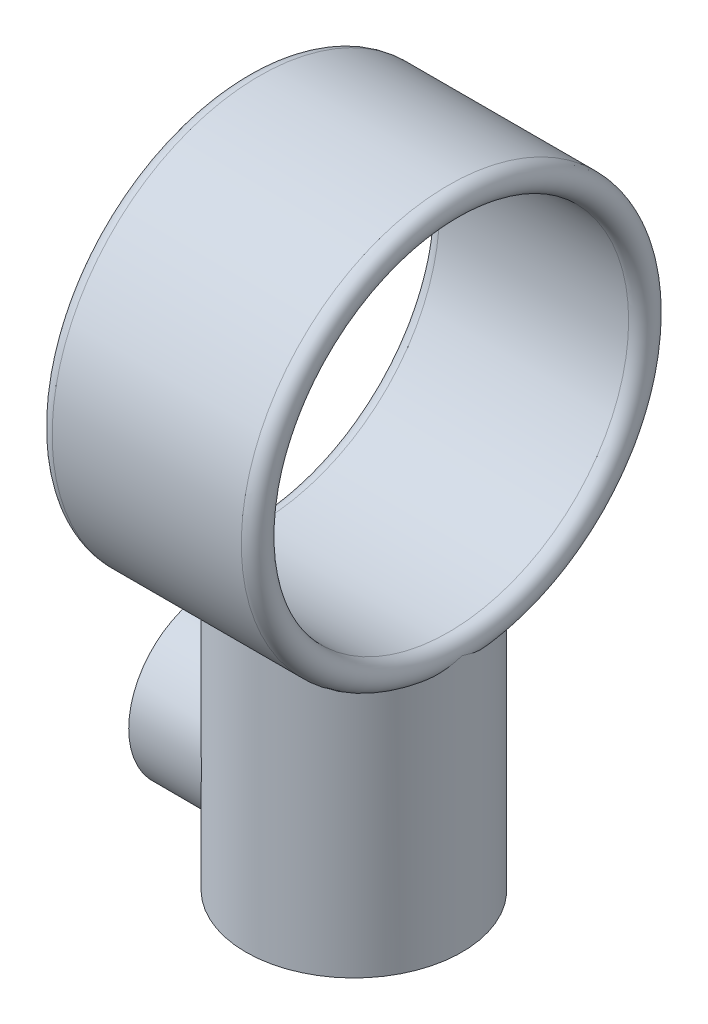
ISO-10303-21;
HEADER;
FILE_DESCRIPTION(('STEP AP214'),'2;1');
FILE_NAME('part.step','',(''),(''),'','','');
FILE_SCHEMA(('AUTOMOTIVE_DESIGN { 1 0 10303 214 1 1 1 1 }'));
ENDSEC;
DATA;
#1=APPLICATION_CONTEXT('core data for automotive mechanical design processes');
#2=APPLICATION_PROTOCOL_DEFINITION('international standard','automotive_design',2000,#1);
#3=PRODUCT_CONTEXT('',#1,'mechanical');
#4=PRODUCT('Part','Part','',(#3));
#5=PRODUCT_RELATED_PRODUCT_CATEGORY('part','',(#4));
#6=PRODUCT_DEFINITION_FORMATION('','',#4);
#7=PRODUCT_DEFINITION_CONTEXT('part definition',#1,'design');
#8=PRODUCT_DEFINITION('design','',#6,#7);
#9=PRODUCT_DEFINITION_SHAPE('','',#8);
#10=(LENGTH_UNIT() NAMED_UNIT(*) SI_UNIT(.MILLI.,.METRE.));
#11=(NAMED_UNIT(*) PLANE_ANGLE_UNIT() SI_UNIT($,.RADIAN.));
#12=(NAMED_UNIT(*) SI_UNIT($,.STERADIAN.) SOLID_ANGLE_UNIT());
#13=UNCERTAINTY_MEASURE_WITH_UNIT(LENGTH_MEASURE(1.E-05),#10,'distance_accuracy_value','');
#14=(GEOMETRIC_REPRESENTATION_CONTEXT(3) GLOBAL_UNCERTAINTY_ASSIGNED_CONTEXT((#13)) GLOBAL_UNIT_ASSIGNED_CONTEXT((#10,
#11,#12)) REPRESENTATION_CONTEXT('',''));
#15=CARTESIAN_POINT('',(0.,0.,0.));
#16=DIRECTION('',(0.,0.,1.));
#17=DIRECTION('',(1.,0.,0.));
#18=AXIS2_PLACEMENT_3D('',#15,#16,#17);
#19=CARTESIAN_POINT('',(-3.70809924354783,10.,0.));
#20=DIRECTION('',(1.,0.,0.));
#21=DIRECTION('',(0.,0.,-1.));
#22=AXIS2_PLACEMENT_3D('',#19,#20,#21);
#23=PLANE('',#22);
#24=CARTESIAN_POINT('',(-3.70809924354783,6.,0.));
#25=DIRECTION('',(1.,0.,0.));
#26=DIRECTION('',(0.,0.,-1.));
#27=AXIS2_PLACEMENT_3D('',#24,#25,#26);
#28=CIRCLE('',#27,1.5);
#29=CARTESIAN_POINT('',(-3.70809924354783,6.,1.5));
#30=VERTEX_POINT('',#29);
#31=CARTESIAN_POINT('',(-3.70809924354783,6.,-1.5));
#32=VERTEX_POINT('',#31);
#33=EDGE_CURVE('E66',#30,#32,#28,.F.);
#34=ORIENTED_EDGE('',*,*,#33,.T.);
#35=DIRECTION('',(0.,-1.,0.));
#36=VECTOR('',#35,1.);
#37=CARTESIAN_POINT('',(-3.70809924354783,10.,-1.5));
#38=LINE('',#37,#36);
#39=CARTESIAN_POINT('',(-3.70809924354783,10.,-1.5));
#40=VERTEX_POINT('',#39);
#41=EDGE_CURVE('E115',#40,#32,#38,.T.);
#42=ORIENTED_EDGE('',*,*,#41,.F.);
#43=DIRECTION('',(0.,0.,1.));
#44=VECTOR('',#43,1.);
#45=CARTESIAN_POINT('',(-3.70809924354783,10.,0.));
#46=LINE('',#45,#44);
#47=CARTESIAN_POINT('',(-3.70809924354783,10.,1.5));
#48=VERTEX_POINT('',#47);
#49=EDGE_CURVE('E361',#40,#48,#46,.T.);
#50=ORIENTED_EDGE('',*,*,#49,.T.);
#51=DIRECTION('',(0.,-1.,0.));
#52=VECTOR('',#51,1.);
#53=CARTESIAN_POINT('',(-3.70809924354783,10.,1.5));
#54=LINE('',#53,#52);
#55=EDGE_CURVE('E118',#48,#30,#54,.T.);
#56=ORIENTED_EDGE('',*,*,#55,.T.);
#57=EDGE_LOOP('',(#34,#42,#50,#56));
#58=FACE_BOUND('',#57,.T.);
#59=ADVANCED_FACE('F45',(#58),#23,.T.);
#60=CARTESIAN_POINT('',(0.,38.001,0.));
#61=DIRECTION('',(0.,-1.,0.));
#62=DIRECTION('',(0.,0.,-1.));
#63=AXIS2_PLACEMENT_3D('',#60,#61,#62);
#64=CYLINDRICAL_SURFACE('',#63,6.);
#65=CARTESIAN_POINT('',(-5.25,13.8728934578661,2.90473750965556));
#66=CARTESIAN_POINT('',(-5.16545083744711,13.9127705274958,3.05755950121399));
#67=CARTESIAN_POINT('',(-5.07449851944559,13.9549493380977,3.20618748854696));
#68=CARTESIAN_POINT('',(-4.88059842888493,14.0426881679961,3.49426359831979));
#69=CARTESIAN_POINT('',(-4.77765518090891,14.0882469095894,3.63371515245411));
#70=CARTESIAN_POINT('',(-4.56036266579937,14.1816224568367,3.90295671131616));
#71=CARTESIAN_POINT('',(-4.44599715516383,14.2294424258153,4.03273248498849));
#72=CARTESIAN_POINT('',(-4.20668306419332,14.326004070393,4.28178043051138));
#73=CARTESIAN_POINT('',(-4.08173338874433,14.374745840962,4.40105151286026));
#74=CARTESIAN_POINT('',(-3.82202654993289,14.4717811308047,4.6283769765949));
#75=CARTESIAN_POINT('',(-3.68727657717876,14.5200749499888,4.7364394434313));
#76=CARTESIAN_POINT('',(-3.40855123542649,14.6148640065689,4.94081366135508));
#77=CARTESIAN_POINT('',(-3.26457635770231,14.6613593395326,5.03712603740368));
#78=CARTESIAN_POINT('',(-2.96812957090151,14.7511050336043,5.21730601959085));
#79=CARTESIAN_POINT('',(-2.8156602232121,14.7943563637643,5.30117734951102));
#80=CARTESIAN_POINT('',(-2.50297273239522,14.876161190341,5.4557805607689));
#81=CARTESIAN_POINT('',(-2.34275458297037,14.9147146829396,5.52651243142803));
#82=CARTESIAN_POINT('',(-2.01838468028311,14.9850483133558,5.65295418327766));
#83=CARTESIAN_POINT('',(-1.8543497737595,15.0169345747475,5.70890389276414));
#84=CARTESIAN_POINT('',(-1.52096581806244,15.0734507795979,5.80661800910458));
#85=CARTESIAN_POINT('',(-1.351619645987,15.0980845790624,5.84838995583623));
#86=CARTESIAN_POINT('',(-1.00913314120326,15.1389917083967,5.91710392755813));
#87=CARTESIAN_POINT('',(-0.835997149047921,15.1552741293284,5.94406208069449));
#88=CARTESIAN_POINT('',(-0.487427727690023,15.1787284785597,5.98273743133931));
#89=CARTESIAN_POINT('',(-0.311994684367149,15.1859019177248,5.9944571563843));
#90=CARTESIAN_POINT('',(0.014898456154254,15.1904470911778,6.00188922956027));
#91=CARTESIAN_POINT('',(0.166300455664945,15.1890429147838,5.99960057509896));
#92=CARTESIAN_POINT('',(0.468270660017704,15.179281646702,5.98360932456145));
#93=CARTESIAN_POINT('',(0.618838898064245,15.1709248339363,5.96990718636529));
#94=CARTESIAN_POINT('',(0.918024530416322,15.1475622872583,5.9312713603667));
#95=CARTESIAN_POINT('',(1.06664165939207,15.1325556584913,5.90633616094247));
#96=CARTESIAN_POINT('',(1.36083888564339,15.096438757638,5.8455716929049));
#97=CARTESIAN_POINT('',(1.50641888995803,15.0753282990174,5.80974209135476));
#98=CARTESIAN_POINT('',(1.92883597054698,15.0052477261695,5.68889393624443));
#99=CARTESIAN_POINT('',(2.20040553295174,14.9487439552119,5.58929867537032));
#100=CARTESIAN_POINT('',(2.72363828628705,14.8214214644377,5.35390893323802));
#101=CARTESIAN_POINT('',(2.97528804700097,14.7505931993137,5.21809029473828));
#102=CARTESIAN_POINT('',(3.48623784079228,14.5914676938904,4.89378523820748));
#103=CARTESIAN_POINT('',(3.74232631838541,14.502095762168,4.70076153775123));
#104=CARTESIAN_POINT('',(4.22026271887615,14.3223800597999,4.27683145749983));
#105=CARTESIAN_POINT('',(4.44213765172656,14.2320371166239,4.04595526063284));
#106=CARTESIAN_POINT('',(4.75830189696992,14.0967473090789,3.65934294999487));
#107=CARTESIAN_POINT('',(4.86583204867643,14.0492872361129,3.51513265629614));
#108=CARTESIAN_POINT('',(5.06784175314055,13.9580350057277,3.21703823558775));
#109=CARTESIAN_POINT('',(5.16233716991498,13.9142384156674,3.06316620553971));
#110=CARTESIAN_POINT('',(5.25,13.8728934578661,2.90473750965556));
#111=B_SPLINE_CURVE_WITH_KNOTS('',3,(#65,#66,#67,#68,#69,#70,#71,#72,#73,#74,#75,#76,#77,#78,
#79,#80,#81,#82,#83,#84,#85,#86,#87,#88,#89,#90,#91,#92,#93,#94,#95,#96,#97,#98,#99,#100,#101,
#102,#103,#104,#105,#106,#107,#108,#109,#110),.UNSPECIFIED.,.F.,.F.,(4,2,2,2,2,2,2,2,2,2,2,2,2,
2,2,2,2,2,2,2,2,2,4),(0.,0.537198992207626,1.07419593375081,1.61196771208423,2.14979520028817,
2.68723198268515,3.22464016754032,3.76188717251165,4.29913461410687,4.82703991833124,
5.35466403566129,5.88171257157474,6.40867367691955,6.86237029036471,7.31604870352783,
7.76978818598553,8.22354153627678,9.10386976454148,9.9847865549833,10.9795066139687,
11.9734373238748,12.5308951645804,13.0876684455294),.UNSPECIFIED.);
#112=CARTESIAN_POINT('',(-5.25,13.8728934578661,2.90473750965556));
#113=VERTEX_POINT('',#112);
#114=CARTESIAN_POINT('',(5.24999999998495,13.8728934578732,2.90473750968277));
#115=VERTEX_POINT('',#114);
#116=EDGE_CURVE('E60',#113,#115,#111,.T.);
#117=ORIENTED_EDGE('',*,*,#116,.F.);
#118=CARTESIAN_POINT('',(-6.,14.25,0.));
#119=CARTESIAN_POINT('',(-6.00000000150005,14.2482787321846,0.00486850603670994));
#120=CARTESIAN_POINT('',(-5.99999407579352,14.2465603430977,0.00973819779422145));
#121=CARTESIAN_POINT('',(-5.99940107988171,14.1607958041451,0.253254865672289));
#122=CARTESIAN_POINT('',(-5.98457196858083,14.0837357908846,0.494713798348243));
#123=CARTESIAN_POINT('',(-5.92441775295515,13.9512042031537,0.980401033440612));
#124=CARTESIAN_POINT('',(-5.87904343224984,13.8957676978917,1.22463317887321));
#125=CARTESIAN_POINT('',(-5.77226781040316,13.8267679380163,1.64785267390334));
#126=CARTESIAN_POINT('',(-5.71802288428123,13.8060910842963,1.82741438960373));
#127=CARTESIAN_POINT('',(-5.62398391824661,13.792216860086,2.09275079530054));
#128=CARTESIAN_POINT('',(-5.59058908539884,13.7904381959896,2.18039171411812));
#129=CARTESIAN_POINT('',(-5.51977433823358,13.7933541732623,2.35390256474518));
#130=CARTESIAN_POINT('',(-5.48235656141722,13.7980453925231,2.43977340842155));
#131=CARTESIAN_POINT('',(-5.40742240777495,13.8140142601761,2.60133664062631));
#132=CARTESIAN_POINT('',(-5.37022938740991,13.8246488351064,2.67724057666068));
#133=CARTESIAN_POINT('',(-5.293152757581,13.8527779985089,2.82660186282994));
#134=CARTESIAN_POINT('',(-5.2532625595122,13.8702899277422,2.90005251520268));
#135=CARTESIAN_POINT('',(-5.21230000000083,13.8916128402081,2.97185610519611));
#136=B_SPLINE_CURVE_WITH_KNOTS('',3,(#118,#119,#120,#121,#122,#123,#124,#125,#126,#127,#128,
#129,#130,#131,#132,#133,#134,#135),.UNSPECIFIED.,.F.,.F.,(4,2,2,2,2,2,2,2,4),(0.,
0.0154919464335938,0.774512988395745,1.53475994978785,2.09884164947625,2.37998548268988,
2.66098066782649,2.91622180303708,3.17211068582444),.UNSPECIFIED.);
#137=CARTESIAN_POINT('',(-6.00000000000002,14.25,0.));
#138=VERTEX_POINT('',#137);
#139=EDGE_CURVE('E182',#138,#113,#136,.T.);
#140=ORIENTED_EDGE('',*,*,#139,.F.);
#141=CARTESIAN_POINT('',(-5.21230000000083,13.8916128402081,-2.97185610519611));
#142=CARTESIAN_POINT('',(-5.25182109042762,13.8710372587971,-2.90257685264227));
#143=CARTESIAN_POINT('',(-5.2903492931489,13.8540109061448,-2.83175727139901));
#144=CARTESIAN_POINT('',(-5.3649333950461,13.8263925575196,-2.68774914206225));
#145=CARTESIAN_POINT('',(-5.40099330471434,13.815789893052,-2.61456473564402));
#146=CARTESIAN_POINT('',(-5.47003424150393,13.8003478003082,-2.46684847144031));
#147=CARTESIAN_POINT('',(-5.50303593881474,13.7954666104389,-2.39233046004732));
#148=CARTESIAN_POINT('',(-5.5660382288427,13.7907312728859,-2.24184660534412));
#149=CARTESIAN_POINT('',(-5.59603713074492,13.7908799416232,-2.16587997468559));
#150=CARTESIAN_POINT('',(-5.66448428144393,13.796647544105,-1.9816208508093));
#151=CARTESIAN_POINT('',(-5.7013717319264,13.8044783931462,-1.87281176845403));
#152=CARTESIAN_POINT('',(-5.76866472612397,13.8277260724853,-1.65398050024608));
#153=CARTESIAN_POINT('',(-5.79906512416681,13.8431488930727,-1.54395742363985));
#154=CARTESIAN_POINT('',(-5.88059826772668,13.8991641247959,-1.21255594288631));
#155=CARTESIAN_POINT('',(-5.92190036224475,13.9494800901576,-0.990286813456896));
#156=CARTESIAN_POINT('',(-5.96689060925225,14.0429897960054,-0.642372380795412));
#157=CARTESIAN_POINT('',(-5.97910851566229,14.0800632827528,-0.515962025347549));
#158=CARTESIAN_POINT('',(-5.99549567692783,14.1590719416185,-0.264329322031675));
#159=CARTESIAN_POINT('',(-5.99967894596839,14.200998513159,-0.139105285407618));
#160=CARTESIAN_POINT('',(-5.99999407970384,14.2465603158051,-0.0097382553445154));
#161=CARTESIAN_POINT('',(-6.00000000571744,14.2482787046798,-0.00486856329305859));
#162=CARTESIAN_POINT('',(-6.,14.25,0.));
#163=B_SPLINE_CURVE_WITH_KNOTS('',3,(#141,#142,#143,#144,#145,#146,#147,#148,#149,#150,#151,
#152,#153,#154,#155,#156,#157,#158,#159,#160,#161,#162),.UNSPECIFIED.,.F.,.F.,(4,2,2,2,2,2,2,2,
2,2,4),(0.,0.246917354826669,0.493423495792143,0.738118933678097,0.982951388687713,
1.32789497540506,1.6731111701109,2.36494018290057,2.76160180374845,3.157570928422,
3.17306287485674),.UNSPECIFIED.);
#164=CARTESIAN_POINT('',(-5.25,13.8728934578661,-2.90473750965556));
#165=VERTEX_POINT('',#164);
#166=EDGE_CURVE('E203',#165,#138,#163,.T.);
#167=ORIENTED_EDGE('',*,*,#166,.F.);
#168=CARTESIAN_POINT('',(5.25,13.8728934578661,-2.90473750965556));
#169=CARTESIAN_POINT('',(5.16545083744711,13.9127705274958,-3.05755950121399));
#170=CARTESIAN_POINT('',(5.07449851944559,13.9549493380977,-3.20618748854696));
#171=CARTESIAN_POINT('',(4.88059842888493,14.0426881679961,-3.49426359831979));
#172=CARTESIAN_POINT('',(4.77765518090891,14.0882469095894,-3.63371515245411));
#173=CARTESIAN_POINT('',(4.56036266579937,14.1816224568367,-3.90295671131616));
#174=CARTESIAN_POINT('',(4.44599715516383,14.2294424258153,-4.03273248498849));
#175=CARTESIAN_POINT('',(4.20668306419332,14.326004070393,-4.28178043051138));
#176=CARTESIAN_POINT('',(4.08173338874433,14.374745840962,-4.40105151286026));
#177=CARTESIAN_POINT('',(3.82202654993289,14.4717811308047,-4.6283769765949));
#178=CARTESIAN_POINT('',(3.68727657717876,14.5200749499888,-4.7364394434313));
#179=CARTESIAN_POINT('',(3.40855123542649,14.6148640065689,-4.94081366135508));
#180=CARTESIAN_POINT('',(3.26457635770231,14.6613593395326,-5.03712603740368));
#181=CARTESIAN_POINT('',(2.96812957090151,14.7511050336043,-5.21730601959085));
#182=CARTESIAN_POINT('',(2.8156602232121,14.7943563637643,-5.30117734951102));
#183=CARTESIAN_POINT('',(2.50297273239522,14.876161190341,-5.4557805607689));
#184=CARTESIAN_POINT('',(2.34275458297037,14.9147146829396,-5.52651243142803));
#185=CARTESIAN_POINT('',(2.01838468028311,14.9850483133558,-5.65295418327766));
#186=CARTESIAN_POINT('',(1.8543497737595,15.0169345747475,-5.70890389276414));
#187=CARTESIAN_POINT('',(1.52096581806244,15.0734507795979,-5.80661800910458));
#188=CARTESIAN_POINT('',(1.351619645987,15.0980845790624,-5.84838995583623));
#189=CARTESIAN_POINT('',(1.00913314120326,15.1389917083967,-5.91710392755813));
#190=CARTESIAN_POINT('',(0.835997149047921,15.1552741293284,-5.94406208069449));
#191=CARTESIAN_POINT('',(0.487427727690023,15.1787284785597,-5.98273743133931));
#192=CARTESIAN_POINT('',(0.311994684367149,15.1859019177248,-5.9944571563843));
#193=CARTESIAN_POINT('',(-0.014898456154254,15.1904470911778,-6.00188922956027));
#194=CARTESIAN_POINT('',(-0.166300455664945,15.1890429147838,-5.99960057509896));
#195=CARTESIAN_POINT('',(-0.468270660017704,15.179281646702,-5.98360932456145));
#196=CARTESIAN_POINT('',(-0.618838898064245,15.1709248339363,-5.96990718636529));
#197=CARTESIAN_POINT('',(-0.918024530416322,15.1475622872583,-5.9312713603667));
#198=CARTESIAN_POINT('',(-1.06664165939207,15.1325556584913,-5.90633616094247));
#199=CARTESIAN_POINT('',(-1.36083888564339,15.096438757638,-5.8455716929049));
#200=CARTESIAN_POINT('',(-1.50641888995803,15.0753282990174,-5.80974209135476));
#201=CARTESIAN_POINT('',(-1.92883597054698,15.0052477261695,-5.68889393624443));
#202=CARTESIAN_POINT('',(-2.20040553295174,14.9487439552119,-5.58929867537032));
#203=CARTESIAN_POINT('',(-2.72363828628705,14.8214214644377,-5.35390893323802));
#204=CARTESIAN_POINT('',(-2.97528804700097,14.7505931993137,-5.21809029473828));
#205=CARTESIAN_POINT('',(-3.48623784079228,14.5914676938904,-4.89378523820748));
#206=CARTESIAN_POINT('',(-3.74232631838541,14.502095762168,-4.70076153775123));
#207=CARTESIAN_POINT('',(-4.22026271887615,14.3223800597999,-4.27683145749983));
#208=CARTESIAN_POINT('',(-4.44213765172656,14.2320371166239,-4.04595526063284));
#209=CARTESIAN_POINT('',(-4.75830189696992,14.0967473090789,-3.65934294999487));
#210=CARTESIAN_POINT('',(-4.86583204867643,14.0492872361129,-3.51513265629614));
#211=CARTESIAN_POINT('',(-5.06784175314055,13.9580350057277,-3.21703823558775));
#212=CARTESIAN_POINT('',(-5.16233716991498,13.9142384156674,-3.06316620553971));
#213=CARTESIAN_POINT('',(-5.25,13.8728934578661,-2.90473750965556));
#214=B_SPLINE_CURVE_WITH_KNOTS('',3,(#168,#169,#170,#171,#172,#173,#174,#175,#176,#177,#178,
#179,#180,#181,#182,#183,#184,#185,#186,#187,#188,#189,#190,#191,#192,#193,#194,#195,#196,#197,
#198,#199,#200,#201,#202,#203,#204,#205,#206,#207,#208,#209,#210,#211,#212,#213),.UNSPECIFIED.,
.F.,.F.,(4,2,2,2,2,2,2,2,2,2,2,2,2,2,2,2,2,2,2,2,2,2,4),(0.,0.537198992207626,1.07419593375081,
1.61196771208423,2.14979520028817,2.68723198268515,3.22464016754032,3.76188717251165,
4.29913461410687,4.82703991833124,5.35466403566129,5.88171257157474,6.40867367691955,
6.86237029036471,7.31604870352783,7.76978818598553,8.22354153627678,9.10386976454148,
9.9847865549833,10.9795066139687,11.9734373238748,12.5308951645804,13.0876684455294),.UNSPECIFIED.);
#215=CARTESIAN_POINT('',(5.25,13.8728934578661,-2.90473750965556));
#216=VERTEX_POINT('',#215);
#217=EDGE_CURVE('E191',#216,#165,#214,.T.);
#218=ORIENTED_EDGE('',*,*,#217,.F.);
#219=CARTESIAN_POINT('',(6.,14.25,0.));
#220=CARTESIAN_POINT('',(6.00000000150005,14.2482787321846,-0.00486850603670994));
#221=CARTESIAN_POINT('',(5.99999407579352,14.2465603430977,-0.00973819779422145));
#222=CARTESIAN_POINT('',(5.99940107988171,14.1607958041451,-0.253254865672289));
#223=CARTESIAN_POINT('',(5.98457196858083,14.0837357908846,-0.494713798348243));
#224=CARTESIAN_POINT('',(5.92441775295515,13.9512042031537,-0.980401033440612));
#225=CARTESIAN_POINT('',(5.87904343224984,13.8957676978917,-1.22463317887321));
#226=CARTESIAN_POINT('',(5.77226781040316,13.8267679380163,-1.64785267390334));
#227=CARTESIAN_POINT('',(5.71802288428123,13.8060910842963,-1.82741438960373));
#228=CARTESIAN_POINT('',(5.62398391824661,13.792216860086,-2.09275079530054));
#229=CARTESIAN_POINT('',(5.59058908539884,13.7904381959896,-2.18039171411812));
#230=CARTESIAN_POINT('',(5.51977433823358,13.7933541732623,-2.35390256474518));
#231=CARTESIAN_POINT('',(5.48235656141722,13.7980453925231,-2.43977340842155));
#232=CARTESIAN_POINT('',(5.40742240777495,13.8140142601761,-2.60133664062631));
#233=CARTESIAN_POINT('',(5.37022938740991,13.8246488351064,-2.67724057666068));
#234=CARTESIAN_POINT('',(5.293152757581,13.8527779985089,-2.82660186282994));
#235=CARTESIAN_POINT('',(5.2532625595122,13.8702899277422,-2.90005251520268));
#236=CARTESIAN_POINT('',(5.21230000000083,13.8916128402081,-2.97185610519611));
#237=B_SPLINE_CURVE_WITH_KNOTS('',3,(#219,#220,#221,#222,#223,#224,#225,#226,#227,#228,#229,
#230,#231,#232,#233,#234,#235,#236),.UNSPECIFIED.,.F.,.F.,(4,2,2,2,2,2,2,2,4),(0.,
0.0154919464335938,0.774512988395745,1.53475994978785,2.09884164947625,2.37998548268988,
2.66098066782649,2.91622180303708,3.17211068582444),.UNSPECIFIED.);
#238=CARTESIAN_POINT('',(6.,14.25,0.));
#239=VERTEX_POINT('',#238);
#240=EDGE_CURVE('E153',#239,#216,#237,.T.);
#241=ORIENTED_EDGE('',*,*,#240,.F.);
#242=CARTESIAN_POINT('',(5.21230000000083,13.8916128402081,2.97185610519611));
#243=CARTESIAN_POINT('',(5.25181244902449,13.8710417445212,2.90259197113957));
#244=CARTESIAN_POINT('',(5.29033246234409,13.8540183350303,2.83178818835904));
#245=CARTESIAN_POINT('',(5.364901539332,13.826403152142,2.68781221222866));
#246=CARTESIAN_POINT('',(5.40095459928393,13.815800747362,2.6146441462728));
#247=CARTESIAN_POINT('',(5.4699981158091,13.8003537046148,2.46692914684027));
#248=CARTESIAN_POINT('',(5.5030080292157,13.7954697523468,2.39239524961968));
#249=CARTESIAN_POINT('',(5.56602530645849,13.7907311998122,2.24187934477962));
#250=CARTESIAN_POINT('',(5.59603099157703,13.7908793958768,2.16589655545817));
#251=CARTESIAN_POINT('',(5.66449611339079,13.7966485811768,1.98158892296316));
#252=CARTESIAN_POINT('',(5.70139361717816,13.8044831977604,1.87274690925351));
#253=CARTESIAN_POINT('',(5.7687028308949,13.8277419981334,1.65385025090798));
#254=CARTESIAN_POINT('',(5.7991092988853,13.8431722829333,1.54379470111772));
#255=CARTESIAN_POINT('',(5.8806242558189,13.8991959351373,1.21241665964414));
#256=CARTESIAN_POINT('',(5.92191475196587,13.949505883272,0.990191111091766));
#257=CARTESIAN_POINT('',(5.96235528661835,14.0335650897944,0.677438056990105));
#258=CARTESIAN_POINT('',(5.97202658334191,14.0597831825297,0.585923937364091));
#259=CARTESIAN_POINT('',(5.98711578862193,14.1149195617391,0.40347678839197));
#260=CARTESIAN_POINT('',(5.99253990398618,14.1438338385577,0.312543104428853));
#261=CARTESIAN_POINT('',(5.99845962114924,14.1969031757254,0.152626870582032));
#262=CARTESIAN_POINT('',(5.99981447111863,14.2205776523293,0.0835128177222028));
#263=CARTESIAN_POINT('',(5.9999940722098,14.2465602917513,0.00973832051849793));
#264=CARTESIAN_POINT('',(5.9999999979339,14.2482786798245,0.00486863041603576));
#265=CARTESIAN_POINT('',(6.,14.25,0.));
#266=B_SPLINE_CURVE_WITH_KNOTS('',3,(#242,#243,#244,#245,#246,#247,#248,#249,#250,#251,#252,
#253,#254,#255,#256,#257,#258,#259,#260,#261,#262,#263,#264,#265),.UNSPECIFIED.,.F.,.F.,(4,2,2,
2,2,2,2,2,2,2,2,4),(0.,0.246863499544829,0.493317136884989,0.738066269693195,0.982951410183558,
1.32799664728654,1.67331948577688,2.36494061200279,2.65193318067626,2.93850555310597,
3.15766179929688,3.17315374573048),.UNSPECIFIED.);
#267=EDGE_CURVE('E162',#115,#239,#266,.T.);
#268=ORIENTED_EDGE('',*,*,#267,.F.);
#269=EDGE_LOOP('',(#117,#140,#167,#218,#241,#268));
#270=FACE_BOUND('',#269,.T.);
#271=CARTESIAN_POINT('',(0.,0.,0.));
#272=DIRECTION('',(0.,1.,0.));
#273=DIRECTION('',(0.,0.,1.));
#274=AXIS2_PLACEMENT_3D('',#271,#272,#273);
#275=CIRCLE('',#274,6.);
#276=CARTESIAN_POINT('',(0.,0.,6.));
#277=VERTEX_POINT('',#276);
#278=EDGE_CURVE('E149',#277,#277,#275,.T.);
#279=ORIENTED_EDGE('',*,*,#278,.T.);
#280=EDGE_LOOP('',(#279));
#281=FACE_BOUND('',#280,.T.);
#282=CARTESIAN_POINT('',(-3.96862696659689,6.,4.5));
#283=CARTESIAN_POINT('',(-3.96861686602156,6.10505815112059,4.50000507834795));
#284=CARTESIAN_POINT('',(-3.97281685144605,6.21008047026828,4.49631419586517));
#285=CARTESIAN_POINT('',(-3.98932854522574,6.41901352963055,4.48167225616228));
#286=CARTESIAN_POINT('',(-4.00164295996593,6.52292388722067,4.47071877665906));
#287=CARTESIAN_POINT('',(-4.033707284754,6.72881637028922,4.44180872189387));
#288=CARTESIAN_POINT('',(-4.05347355390594,6.83079373113411,4.42383673572161));
#289=CARTESIAN_POINT('',(-4.09941990164127,7.03191174766138,4.38129405910782));
#290=CARTESIAN_POINT('',(-4.12560392177312,7.13105061809874,4.35671931259617));
#291=CARTESIAN_POINT('',(-4.21122557626139,7.42059533834582,4.27454643757329));
#292=CARTESIAN_POINT('',(-4.27828714788483,7.60627618334236,4.20803426948237));
#293=CARTESIAN_POINT('',(-4.42460194939491,7.96307650543022,4.05390989402712));
#294=CARTESIAN_POINT('',(-4.50385370535403,8.134197739059,3.96630023685818));
#295=CARTESIAN_POINT('',(-4.68531341730852,8.49631856413311,3.75120672461472));
#296=CARTESIAN_POINT('',(-4.78885287141313,8.68397491718937,3.61921460613339));
#297=CARTESIAN_POINT('',(-4.99564919290702,9.03760532706233,3.32798047453304));
#298=CARTESIAN_POINT('',(-5.09890541333799,9.20354680994889,3.16869833241077));
#299=CARTESIAN_POINT('',(-5.2580758871422,9.44997213201626,2.89258319383619));
#300=CARTESIAN_POINT('',(-5.31649921498475,9.53821330942545,2.78403025278293));
#301=CARTESIAN_POINT('',(-5.42903557769029,9.70516421665039,2.55764383078973));
#302=CARTESIAN_POINT('',(-5.48314764230641,9.7838718029999,2.43980827260275));
#303=CARTESIAN_POINT('',(-5.58542936763005,9.93062086018855,2.19555612221114));
#304=CARTESIAN_POINT('',(-5.63361018010823,9.99868241470308,2.06915634837479));
#305=CARTESIAN_POINT('',(-5.72264868834269,10.1231779320002,1.80839242601432));
#306=CARTESIAN_POINT('',(-5.76351025654376,10.1796180457992,1.67403253937858));
#307=CARTESIAN_POINT('',(-5.85098111190475,10.2995686610311,1.34369921738146));
#308=CARTESIAN_POINT('',(-5.89347882975047,10.3570567171005,1.14436283139103));
#309=CARTESIAN_POINT('',(-5.95818156512859,10.4441849061431,0.736633167118945));
#310=CARTESIAN_POINT('',(-5.98040421262312,10.4738492335612,0.528247922689992));
#311=CARTESIAN_POINT('',(-6.00273790900922,10.5036612862254,0.107601910306219));
#312=CARTESIAN_POINT('',(-6.00279150279405,10.5037323150967,-0.104667502038759));
#313=CARTESIAN_POINT('',(-5.98062709423096,10.4741472379345,-0.525950245750401));
#314=CARTESIAN_POINT('',(-5.95840393422349,10.4444842476868,-0.734962811689909));
#315=CARTESIAN_POINT('',(-5.89474110936898,10.3587565812862,-1.1366671291912));
#316=CARTESIAN_POINT('',(-5.85398567140415,10.3036309490464,-1.32967268311154));
#317=CARTESIAN_POINT('',(-5.75646842129018,10.1700131452614,-1.70304157676307));
#318=CARTESIAN_POINT('',(-5.69970311910813,10.0915158786635,-1.88340214926542));
#319=CARTESIAN_POINT('',(-5.56683136038152,9.90441113217357,-2.24765072773046));
#320=CARTESIAN_POINT('',(-5.48929621311765,9.7934637039333,-2.42980614387423));
#321=CARTESIAN_POINT('',(-5.32382107964182,9.5497988943042,-2.77370176192021));
#322=CARTESIAN_POINT('',(-5.2358722447546,9.41706296134507,-2.9354243570541));
#323=CARTESIAN_POINT('',(-5.03681297456601,9.10432995061147,-3.26724612468181));
#324=CARTESIAN_POINT('',(-4.92454967628686,8.92017236596872,-3.43273478808484));
#325=CARTESIAN_POINT('',(-4.70177874821713,8.52649625308814,-3.7320262687465));
#326=CARTESIAN_POINT('',(-4.59127197811528,8.31696571431596,-3.86581399076325));
#327=CARTESIAN_POINT('',(-4.40458278221522,7.91705437891275,-4.07619618880003));
#328=CARTESIAN_POINT('',(-4.32592800158729,7.73103882932557,-4.15886599457748));
#329=CARTESIAN_POINT('',(-4.18610222985197,7.34380419043514,-4.299581924703));
#330=CARTESIAN_POINT('',(-4.12489183040204,7.14262068924076,-4.35768369642175));
#331=CARTESIAN_POINT('',(-4.03920154203032,6.76893906512399,-4.43707152670479));
#332=CARTESIAN_POINT('',(-4.00984626605528,6.59865840521033,-4.46337197039467));
#333=CARTESIAN_POINT('',(-3.97306757390254,6.25393394947104,-4.4961529329497));
#334=CARTESIAN_POINT('',(-3.96561609832579,6.07949576875216,-4.5026588096003));
#335=CARTESIAN_POINT('',(-3.97388635724634,5.73156173586498,-4.49535767990839));
#336=CARTESIAN_POINT('',(-3.98961662125085,5.55806625413167,-4.48154319688053));
#337=CARTESIAN_POINT('',(-4.04163546634408,5.21677635932816,-4.4346774009636));
#338=CARTESIAN_POINT('',(-4.0779591349775,5.04899219590173,-4.40159325331275));
#339=CARTESIAN_POINT('',(-4.18283837891057,4.66096114193968,-4.30241066255208));
#340=CARTESIAN_POINT('',(-4.25836937509164,4.44458383481125,-4.22859010341977));
#341=CARTESIAN_POINT('',(-4.38416713744595,4.13455616053397,-4.09668298226641));
#342=CARTESIAN_POINT('',(-4.4282477660934,4.03351661386866,-4.04911000925136));
#343=CARTESIAN_POINT('',(-4.51931162288264,3.83625106567967,-3.94721295720354));
#344=CARTESIAN_POINT('',(-4.5662945886689,3.74002463049577,-3.89288948793124));
#345=CARTESIAN_POINT('',(-4.71319006454584,3.45201970218018,-3.71615208503649));
#346=CARTESIAN_POINT('',(-4.81595841514037,3.26814227565173,-3.5830641309921));
#347=CARTESIAN_POINT('',(-5.02045330209717,2.9219527866886,-3.29043603837133));
#348=CARTESIAN_POINT('',(-5.12217930670151,2.75965127059513,-3.13088304866255));
#349=CARTESIAN_POINT('',(-5.27933355837735,2.51773579975994,-2.85363567533713));
#350=CARTESIAN_POINT('',(-5.33733448882717,2.4305742634367,-2.74391171722405));
#351=CARTESIAN_POINT('',(-5.44883911627977,2.26589638128035,-2.51521929055227));
#352=CARTESIAN_POINT('',(-5.50234179153667,2.18838222486902,-2.39624873344239));
#353=CARTESIAN_POINT('',(-5.60323071595795,2.04413808487518,-2.14976703494853));
#354=CARTESIAN_POINT('',(-5.65062726191312,1.97738989738852,-2.02227083702306));
#355=CARTESIAN_POINT('',(-5.73791214360087,1.85567494950025,-1.75941796478049));
#356=CARTESIAN_POINT('',(-5.77780453006812,1.80070183069776,-1.62406558315541));
#357=CARTESIAN_POINT('',(-5.8625350904621,1.68474081875156,-1.29236039433729));
#358=CARTESIAN_POINT('',(-5.90325172436759,1.62974429690908,-1.09277519250827));
#359=CARTESIAN_POINT('',(-5.96432057289531,1.54759894748724,-0.685068396776803));
#360=CARTESIAN_POINT('',(-5.98469099424157,1.52042522224588,-0.47695460859646));
#361=CARTESIAN_POINT('',(-6.00340361255943,1.49545476953564,-0.0574495386164313));
#362=CARTESIAN_POINT('',(-6.00169409922428,1.49772700334377,0.153948278458668));
#363=CARTESIAN_POINT('',(-5.97626500489896,1.53168191823405,0.573028832872202));
#364=CARTESIAN_POINT('',(-5.95253956039434,1.56337243430354,0.780710565483972));
#365=CARTESIAN_POINT('',(-5.88610179466113,1.65292501922646,1.18056534386478));
#366=CARTESIAN_POINT('',(-5.84396066059587,1.71000061587845,1.37301358555456));
#367=CARTESIAN_POINT('',(-5.7438816804581,1.84736412492764,1.74498415329848));
#368=CARTESIAN_POINT('',(-5.68594045552021,1.92765700258585,1.92450370414687));
#369=CARTESIAN_POINT('',(-5.55052924444481,2.11883383161,2.28764305847074));
#370=CARTESIAN_POINT('',(-5.47159056710846,2.23215278448309,2.46942370394309));
#371=CARTESIAN_POINT('',(-5.3035651964035,2.48059933126717,2.81224444137554));
#372=CARTESIAN_POINT('',(-5.21446919850901,2.61574696915089,2.97326522407355));
#373=CARTESIAN_POINT('',(-5.01319054977144,2.93401603105579,3.30337143548387));
#374=CARTESIAN_POINT('',(-4.89992751303416,3.1213389104418,3.46775082401058));
#375=CARTESIAN_POINT('',(-4.67598263606599,3.52160450368283,3.76425752510136));
#376=CARTESIAN_POINT('',(-4.56530175491737,3.7345565615763,3.89637302120328));
#377=CARTESIAN_POINT('',(-4.38148756734115,4.13664890225275,4.10087937073646));
#378=CARTESIAN_POINT('',(-4.30540715099549,4.32100209395686,4.18000656903781));
#379=CARTESIAN_POINT('',(-4.17097853448613,4.704251585684,4.31416116404684));
#380=CARTESIAN_POINT('',(-4.11258337465199,4.90310760062729,4.36925255772105));
#381=CARTESIAN_POINT('',(-4.03596853197065,5.25235721729373,4.43991376358634));
#382=CARTESIAN_POINT('',(-4.01099047058823,5.39987723160655,4.46233401591204));
#383=CARTESIAN_POINT('',(-3.97733228509945,5.69829096503784,4.49236863125038));
#384=CARTESIAN_POINT('',(-3.96864146660919,5.84918240452107,4.49999270971154));
#385=CARTESIAN_POINT('',(-3.96862696659689,6.,4.5));
#386=B_SPLINE_CURVE_WITH_KNOTS('',3,(#282,#283,#284,#285,#286,#287,#288,#289,#290,#291,#292,
#293,#294,#295,#296,#297,#298,#299,#300,#301,#302,#303,#304,#305,#306,#307,#308,#309,#310,#311,
#312,#313,#314,#315,#316,#317,#318,#319,#320,#321,#322,#323,#324,#325,#326,#327,#328,#329,#330,
#331,#332,#333,#334,#335,#336,#337,#338,#339,#340,#341,#342,#343,#344,#345,#346,#347,#348,#349,
#350,#351,#352,#353,#354,#355,#356,#357,#358,#359,#360,#361,#362,#363,#364,#365,#366,#367,#368,
#369,#370,#371,#372,#373,#374,#375,#376,#377,#378,#379,#380,#381,#382,#383,#384,#385),
.UNSPECIFIED.,.T.,.F.,(4,2,2,2,2,2,2,2,2,2,2,2,2,2,2,2,2,2,2,2,2,2,2,2,2,2,2,2,2,2,2,2,2,2,2,2,
2,2,2,2,2,2,2,2,2,2,2,2,2,2,2,4),(0.,0.314967992529364,0.630041088741451,0.945809933215822,
1.26177319948835,1.88414018859978,2.5064319857564,3.25906029247443,4.01280496269484,
4.46706137040636,4.92141972113399,5.37491031193943,5.82816025795595,6.46055479293371,
7.09239891072839,7.72588055644125,8.3595089038457,8.97143571145856,9.58349601786713,
10.2618283581139,10.9407412812369,11.7532085507481,12.566061924045,13.218705318923,
13.8698624329972,14.3919632009841,14.9133948507528,15.4350184043934,15.9575333954876,
16.675623880679,17.0355922774015,17.395528182415,18.1405045759422,18.885843786639,
19.3402547507057,19.7947686536143,20.2485057859156,20.7019972842673,21.3320515125032,
21.9615414328458,22.5925058597017,23.2236383798887,23.8364490074277,24.4493907880503,
25.1317662013587,25.8147717990097,26.632892044015,27.4513114729263,28.0930130158954,
28.7329953998513,29.1854489890176,29.6376053879207),.UNSPECIFIED.);
#387=CARTESIAN_POINT('',(-3.96862696659689,6.,4.5));
#388=VERTEX_POINT('',#387);
#389=EDGE_CURVE('E12',#388,#388,#386,.T.);
#390=ORIENTED_EDGE('',*,*,#389,.F.);
#391=EDGE_LOOP('',(#390));
#392=FACE_BOUND('',#391,.T.);
#393=ADVANCED_FACE('F171',(#270,#281,#392),#64,.T.);
#394=CARTESIAN_POINT('',(-5.25,25.,0.));
#395=DIRECTION('',(1.,0.,0.));
#396=DIRECTION('',(0.,0.,-1.));
#397=AXIS2_PLACEMENT_3D('',#394,#395,#396);
#398=TOROIDAL_SURFACE('',#397,10.75,0.749999999999994);
#399=CARTESIAN_POINT('',(-5.25,25.,0.));
#400=DIRECTION('',(1.,0.,0.));
#401=DIRECTION('',(0.,0.,-1.));
#402=AXIS2_PLACEMENT_3D('',#399,#400,#401);
#403=CIRCLE('',#402,10.);
#404=CARTESIAN_POINT('',(-5.25,25.,-10.));
#405=VERTEX_POINT('',#404);
#406=EDGE_CURVE('E228',#405,#405,#403,.T.);
#407=ORIENTED_EDGE('',*,*,#406,.T.);
#408=EDGE_LOOP('',(#407));
#409=FACE_BOUND('',#408,.T.);
#410=ORIENTED_EDGE('',*,*,#166,.T.);
#411=ORIENTED_EDGE('',*,*,#139,.T.);
#412=CARTESIAN_POINT('',(-5.25,25.,0.));
#413=DIRECTION('',(1.,0.,0.));
#414=DIRECTION('',(0.,0.,-1.));
#415=AXIS2_PLACEMENT_3D('',#412,#413,#414);
#416=CIRCLE('',#415,11.5);
#417=EDGE_CURVE('E215',#165,#113,#416,.T.);
#418=ORIENTED_EDGE('',*,*,#417,.F.);
#419=EDGE_LOOP('',(#410,#411,#418));
#420=FACE_BOUND('',#419,.T.);
#421=ADVANCED_FACE('F47',(#409,#420),#398,.T.);
#422=CARTESIAN_POINT('',(5.25,25.,0.));
#423=DIRECTION('',(1.,0.,0.));
#424=DIRECTION('',(0.,0.,-1.));
#425=AXIS2_PLACEMENT_3D('',#422,#423,#424);
#426=TOROIDAL_SURFACE('',#425,10.75,0.749999999999994);
#427=CARTESIAN_POINT('',(5.25,25.,0.));
#428=DIRECTION('',(1.,0.,0.));
#429=DIRECTION('',(0.,0.,-1.));
#430=AXIS2_PLACEMENT_3D('',#427,#428,#429);
#431=CIRCLE('',#430,10.);
#432=CARTESIAN_POINT('',(5.25,25.,-10.));
#433=VERTEX_POINT('',#432);
#434=EDGE_CURVE('E231',#433,#433,#431,.T.);
#435=ORIENTED_EDGE('',*,*,#434,.F.);
#436=EDGE_LOOP('',(#435));
#437=FACE_BOUND('',#436,.T.);
#438=CARTESIAN_POINT('',(5.25,25.,0.));
#439=DIRECTION('',(1.,0.,0.));
#440=DIRECTION('',(0.,0.,-1.));
#441=AXIS2_PLACEMENT_3D('',#438,#439,#440);
#442=CIRCLE('',#441,11.5);
#443=EDGE_CURVE('E220',#216,#115,#442,.T.);
#444=ORIENTED_EDGE('',*,*,#443,.T.);
#445=ORIENTED_EDGE('',*,*,#267,.T.);
#446=ORIENTED_EDGE('',*,*,#240,.T.);
#447=EDGE_LOOP('',(#444,#445,#446));
#448=FACE_BOUND('',#447,.T.);
#449=ADVANCED_FACE('F168',(#437,#448),#426,.T.);
#450=CARTESIAN_POINT('',(0.,25.,0.));
#451=DIRECTION('',(1.,0.,0.));
#452=DIRECTION('',(0.,0.,-1.));
#453=AXIS2_PLACEMENT_3D('',#450,#451,#452);
#454=CYLINDRICAL_SURFACE('',#453,11.5);
#455=ORIENTED_EDGE('',*,*,#417,.T.);
#456=ORIENTED_EDGE('',*,*,#116,.T.);
#457=ORIENTED_EDGE('',*,*,#443,.F.);
#458=ORIENTED_EDGE('',*,*,#217,.T.);
#459=EDGE_LOOP('',(#455,#456,#457,#458));
#460=FACE_BOUND('',#459,.T.);
#461=ADVANCED_FACE('F177',(#460),#454,.T.);
#462=CARTESIAN_POINT('',(0.,25.,0.));
#463=DIRECTION('',(1.,0.,0.));
#464=DIRECTION('',(0.,0.,-1.));
#465=AXIS2_PLACEMENT_3D('',#462,#463,#464);
#466=CYLINDRICAL_SURFACE('',#465,10.);
#467=ORIENTED_EDGE('',*,*,#434,.T.);
#468=EDGE_LOOP('',(#467));
#469=FACE_BOUND('',#468,.T.);
#470=ORIENTED_EDGE('',*,*,#406,.F.);
#471=EDGE_LOOP('',(#470));
#472=FACE_BOUND('',#471,.T.);
#473=ADVANCED_FACE('F242',(#469,#472),#466,.F.);
#474=CARTESIAN_POINT('',(0.,0.,0.));
#475=DIRECTION('',(0.,1.,0.));
#476=DIRECTION('',(0.,0.,1.));
#477=AXIS2_PLACEMENT_3D('',#474,#475,#476);
#478=PLANE('',#477);
#479=DIRECTION('',(0.,0.,1.));
#480=VECTOR('',#479,1.);
#481=CARTESIAN_POINT('',(-3.70809924354783,0.,0.));
#482=LINE('',#481,#480);
#483=CARTESIAN_POINT('',(-3.70809924354783,0.,-1.5));
#484=VERTEX_POINT('',#483);
#485=CARTESIAN_POINT('',(-3.70809924354783,0.,1.5));
#486=VERTEX_POINT('',#485);
#487=EDGE_CURVE('E109',#484,#486,#482,.T.);
#488=ORIENTED_EDGE('',*,*,#487,.T.);
#489=CARTESIAN_POINT('',(0.,0.,0.));
#490=DIRECTION('',(0.,1.,0.));
#491=DIRECTION('',(0.,0.,1.));
#492=AXIS2_PLACEMENT_3D('',#489,#490,#491);
#493=CIRCLE('',#492,4.);
#494=EDGE_CURVE('E133',#486,#484,#493,.T.);
#495=ORIENTED_EDGE('',*,*,#494,.T.);
#496=EDGE_LOOP('',(#488,#495));
#497=FACE_BOUND('',#496,.T.);
#498=ORIENTED_EDGE('',*,*,#278,.F.);
#499=EDGE_LOOP('',(#498));
#500=FACE_BOUND('',#499,.T.);
#501=ADVANCED_FACE('F176',(#497,#500),#478,.F.);
#502=CARTESIAN_POINT('',(-8.,0.,0.));
#503=DIRECTION('',(1.,0.,0.));
#504=DIRECTION('',(0.,0.,-1.));
#505=AXIS2_PLACEMENT_3D('',#502,#503,#504);
#506=PLANE('',#505);
#507=CARTESIAN_POINT('',(-8.,6.,0.));
#508=DIRECTION('',(1.,0.,0.));
#509=DIRECTION('',(0.,0.,-1.));
#510=AXIS2_PLACEMENT_3D('',#507,#508,#509);
#511=CIRCLE('',#510,3.);
#512=CARTESIAN_POINT('',(-8.,6.,-3.));
#513=VERTEX_POINT('',#512);
#514=EDGE_CURVE('E137',#513,#513,#511,.T.);
#515=ORIENTED_EDGE('',*,*,#514,.T.);
#516=EDGE_LOOP('',(#515));
#517=FACE_BOUND('',#516,.T.);
#518=CARTESIAN_POINT('',(-8.,6.,0.));
#519=DIRECTION('',(1.,0.,0.));
#520=DIRECTION('',(0.,0.,-1.));
#521=AXIS2_PLACEMENT_3D('',#518,#519,#520);
#522=CIRCLE('',#521,4.5);
#523=CARTESIAN_POINT('',(-8.,6.,-4.5));
#524=VERTEX_POINT('',#523);
#525=EDGE_CURVE('E142',#524,#524,#522,.T.);
#526=ORIENTED_EDGE('',*,*,#525,.F.);
#527=EDGE_LOOP('',(#526));
#528=FACE_BOUND('',#527,.T.);
#529=ADVANCED_FACE('F274',(#517,#528),#506,.F.);
#530=CARTESIAN_POINT('',(6.001,6.,0.));
#531=DIRECTION('',(-1.,0.,0.));
#532=DIRECTION('',(0.,0.,1.));
#533=AXIS2_PLACEMENT_3D('',#530,#531,#532);
#534=CYLINDRICAL_SURFACE('',#533,4.5);
#535=ORIENTED_EDGE('',*,*,#525,.T.);
#536=EDGE_LOOP('',(#535));
#537=FACE_BOUND('',#536,.T.);
#538=ORIENTED_EDGE('',*,*,#389,.T.);
#539=EDGE_LOOP('',(#538));
#540=FACE_BOUND('',#539,.T.);
#541=ADVANCED_FACE('F268',(#537,#540),#534,.T.);
#542=CARTESIAN_POINT('',(-6.,6.,0.));
#543=DIRECTION('',(-1.,0.,0.));
#544=DIRECTION('',(0.,0.,1.));
#545=AXIS2_PLACEMENT_3D('',#542,#543,#544);
#546=CYLINDRICAL_SURFACE('',#545,3.);
#547=CARTESIAN_POINT('',(-6.,6.,0.));
#548=DIRECTION('',(1.,0.,0.));
#549=DIRECTION('',(0.,0.,-1.));
#550=AXIS2_PLACEMENT_3D('',#547,#548,#549);
#551=CIRCLE('',#550,3.);
#552=CARTESIAN_POINT('',(-6.,6.,-3.));
#553=VERTEX_POINT('',#552);
#554=EDGE_CURVE('E138',#553,#553,#551,.T.);
#555=ORIENTED_EDGE('',*,*,#554,.T.);
#556=EDGE_LOOP('',(#555));
#557=FACE_BOUND('',#556,.T.);
#558=ORIENTED_EDGE('',*,*,#514,.F.);
#559=EDGE_LOOP('',(#558));
#560=FACE_BOUND('',#559,.T.);
#561=ADVANCED_FACE('F263',(#557,#560),#546,.F.);
#562=CARTESIAN_POINT('',(-6.,0.,0.));
#563=DIRECTION('',(1.,0.,0.));
#564=DIRECTION('',(0.,0.,-1.));
#565=AXIS2_PLACEMENT_3D('',#562,#563,#564);
#566=PLANE('',#565);
#567=CARTESIAN_POINT('',(-6.,6.,0.));
#568=DIRECTION('',(-1.,0.,0.));
#569=DIRECTION('',(0.,0.,1.));
#570=AXIS2_PLACEMENT_3D('',#567,#568,#569);
#571=CIRCLE('',#570,1.5);
#572=CARTESIAN_POINT('',(-6.,6.,1.5));
#573=VERTEX_POINT('',#572);
#574=EDGE_CURVE('E120',#573,#573,#571,.T.);
#575=ORIENTED_EDGE('',*,*,#574,.F.);
#576=EDGE_LOOP('',(#575));
#577=FACE_BOUND('',#576,.T.);
#578=ORIENTED_EDGE('',*,*,#554,.F.);
#579=EDGE_LOOP('',(#578));
#580=FACE_BOUND('',#579,.T.);
#581=ADVANCED_FACE('F257',(#577,#580),#566,.F.);
#582=EDGE_CURVE('E104',#32,#30,#28,.F.);
#583=ORIENTED_EDGE('',*,*,#582,.T.);
#584=EDGE_CURVE('E129',#30,#486,#54,.T.);
#585=ORIENTED_EDGE('',*,*,#584,.T.);
#586=ORIENTED_EDGE('',*,*,#487,.F.);
#587=EDGE_CURVE('E74',#32,#484,#38,.T.);
#588=ORIENTED_EDGE('',*,*,#587,.F.);
#589=EDGE_LOOP('',(#583,#585,#586,#588));
#590=FACE_BOUND('',#589,.T.);
#591=ADVANCED_FACE('F121',(#590),#23,.T.);
#592=CARTESIAN_POINT('',(0.,10.,0.));
#593=DIRECTION('',(0.,-1.,0.));
#594=DIRECTION('',(0.,0.,-1.));
#595=AXIS2_PLACEMENT_3D('',#592,#593,#594);
#596=CYLINDRICAL_SURFACE('',#595,4.);
#597=ORIENTED_EDGE('',*,*,#494,.F.);
#598=ORIENTED_EDGE('',*,*,#584,.F.);
#599=ORIENTED_EDGE('',*,*,#55,.F.);
#600=CARTESIAN_POINT('',(0.,10.,0.));
#601=DIRECTION('',(0.,1.,0.));
#602=DIRECTION('',(0.,0.,1.));
#603=AXIS2_PLACEMENT_3D('',#600,#601,#602);
#604=CIRCLE('',#603,4.);
#605=EDGE_CURVE('E125',#48,#40,#604,.T.);
#606=ORIENTED_EDGE('',*,*,#605,.T.);
#607=ORIENTED_EDGE('',*,*,#41,.T.);
#608=ORIENTED_EDGE('',*,*,#587,.T.);
#609=EDGE_LOOP('',(#597,#598,#599,#606,#607,#608));
#610=FACE_BOUND('',#609,.T.);
#611=ADVANCED_FACE('F127',(#610),#596,.F.);
#612=CARTESIAN_POINT('',(0.,10.,0.));
#613=DIRECTION('',(0.,1.,0.));
#614=DIRECTION('',(0.,0.,1.));
#615=AXIS2_PLACEMENT_3D('',#612,#613,#614);
#616=PLANE('',#615);
#617=ORIENTED_EDGE('',*,*,#49,.F.);
#618=ORIENTED_EDGE('',*,*,#605,.F.);
#619=EDGE_LOOP('',(#617,#618));
#620=FACE_BOUND('',#619,.T.);
#621=ADVANCED_FACE('F262',(#620),#616,.F.);
#622=CARTESIAN_POINT('',(0.534541443571455,6.,0.));
#623=DIRECTION('',(-1.,0.,0.));
#624=DIRECTION('',(0.,0.,1.));
#625=AXIS2_PLACEMENT_3D('',#622,#623,#624);
#626=CYLINDRICAL_SURFACE('',#625,1.5);
#627=ORIENTED_EDGE('',*,*,#574,.T.);
#628=EDGE_LOOP('',(#627));
#629=FACE_BOUND('',#628,.T.);
#630=ORIENTED_EDGE('',*,*,#582,.F.);
#631=ORIENTED_EDGE('',*,*,#33,.F.);
#632=EDGE_LOOP('',(#630,#631));
#633=FACE_BOUND('',#632,.T.);
#634=ADVANCED_FACE('F105',(#629,#633),#626,.F.);
#635=CLOSED_SHELL('',(#59,#393,#421,#449,#461,#473,#501,#529,#541,#561,#581,#591,#611,#621,#634));
#636=MANIFOLD_SOLID_BREP('B2',#635);
#637=ADVANCED_BREP_SHAPE_REPRESENTATION('',(#18,#636),#14);
#638=SHAPE_DEFINITION_REPRESENTATION(#9,#637);
ENDSEC;
END-ISO-10303-21;
